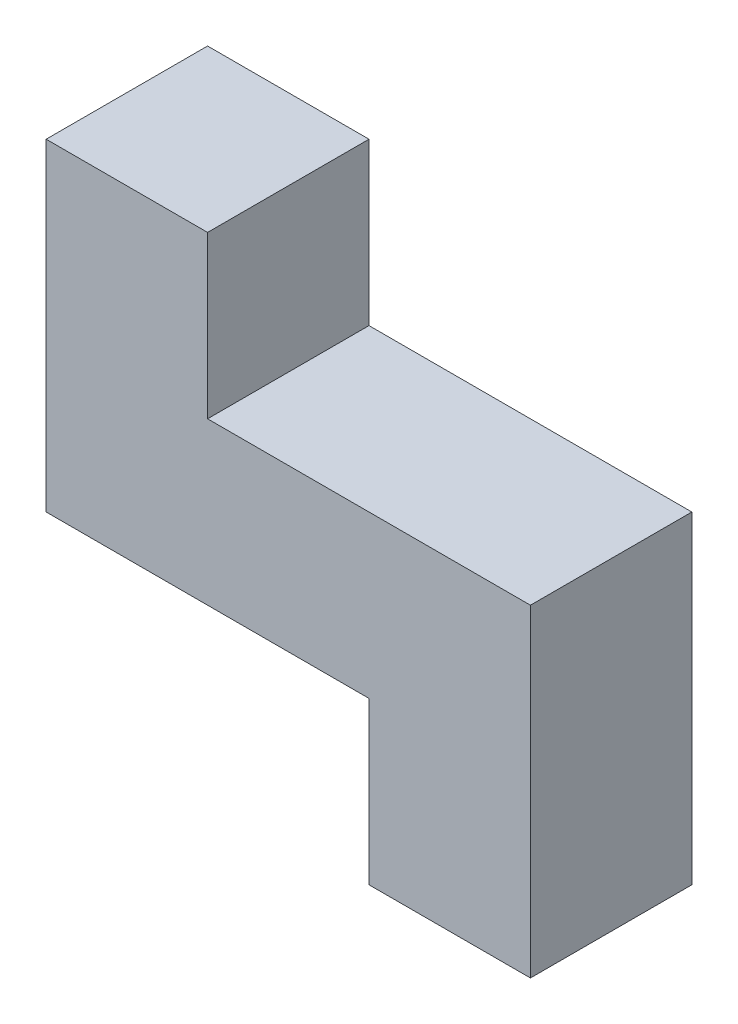
ISO-10303-21;
HEADER;
FILE_DESCRIPTION(('STEP AP214'),'2;1');
FILE_NAME('part.step','',(''),(''),'','','');
FILE_SCHEMA(('AUTOMOTIVE_DESIGN { 1 0 10303 214 1 1 1 1 }'));
ENDSEC;
DATA;
#1=APPLICATION_CONTEXT('core data for automotive mechanical design processes');
#2=APPLICATION_PROTOCOL_DEFINITION('international standard','automotive_design',2000,#1);
#3=PRODUCT_CONTEXT('',#1,'mechanical');
#4=PRODUCT('Part','Part','',(#3));
#5=PRODUCT_RELATED_PRODUCT_CATEGORY('part','',(#4));
#6=PRODUCT_DEFINITION_FORMATION('','',#4);
#7=PRODUCT_DEFINITION_CONTEXT('part definition',#1,'design');
#8=PRODUCT_DEFINITION('design','',#6,#7);
#9=PRODUCT_DEFINITION_SHAPE('','',#8);
#10=(LENGTH_UNIT() NAMED_UNIT(*) SI_UNIT(.MILLI.,.METRE.));
#11=(NAMED_UNIT(*) PLANE_ANGLE_UNIT() SI_UNIT($,.RADIAN.));
#12=(NAMED_UNIT(*) SI_UNIT($,.STERADIAN.) SOLID_ANGLE_UNIT());
#13=UNCERTAINTY_MEASURE_WITH_UNIT(LENGTH_MEASURE(1.E-05),#10,'distance_accuracy_value','');
#14=(GEOMETRIC_REPRESENTATION_CONTEXT(3) GLOBAL_UNCERTAINTY_ASSIGNED_CONTEXT((#13)) GLOBAL_UNIT_ASSIGNED_CONTEXT((#10,
#11,#12)) REPRESENTATION_CONTEXT('',''));
#15=CARTESIAN_POINT('',(0.,0.,0.));
#16=DIRECTION('',(0.,0.,1.));
#17=DIRECTION('',(1.,0.,0.));
#18=AXIS2_PLACEMENT_3D('',#15,#16,#17);
#19=CARTESIAN_POINT('',(25.4,76.2,25.4));
#20=DIRECTION('',(0.,-1.,0.));
#21=DIRECTION('',(0.,0.,-1.));
#22=AXIS2_PLACEMENT_3D('',#19,#20,#21);
#23=PLANE('',#22);
#24=DIRECTION('',(-1.,0.,0.));
#25=VECTOR('',#24,1.);
#26=CARTESIAN_POINT('',(25.4,76.2,0.));
#27=LINE('',#26,#25);
#28=CARTESIAN_POINT('',(25.4,76.2,0.));
#29=VERTEX_POINT('',#28);
#30=CARTESIAN_POINT('',(0.,76.2,0.));
#31=VERTEX_POINT('',#30);
#32=EDGE_CURVE('E129',#29,#31,#27,.T.);
#33=ORIENTED_EDGE('',*,*,#32,.T.);
#34=DIRECTION('',(0.,0.,-1.));
#35=VECTOR('',#34,1.);
#36=CARTESIAN_POINT('',(0.,76.2,25.4));
#37=LINE('',#36,#35);
#38=CARTESIAN_POINT('',(0.,76.2,25.4));
#39=VERTEX_POINT('',#38);
#40=EDGE_CURVE('E11',#39,#31,#37,.T.);
#41=ORIENTED_EDGE('',*,*,#40,.F.);
#42=DIRECTION('',(-1.,0.,0.));
#43=VECTOR('',#42,1.);
#44=CARTESIAN_POINT('',(25.4,76.2,25.4));
#45=LINE('',#44,#43);
#46=CARTESIAN_POINT('',(25.4,76.2,25.4));
#47=VERTEX_POINT('',#46);
#48=EDGE_CURVE('E143',#47,#39,#45,.T.);
#49=ORIENTED_EDGE('',*,*,#48,.F.);
#50=DIRECTION('',(0.,0.,-1.));
#51=VECTOR('',#50,1.);
#52=CARTESIAN_POINT('',(25.4,76.2,25.4));
#53=LINE('',#52,#51);
#54=EDGE_CURVE('E125',#47,#29,#53,.T.);
#55=ORIENTED_EDGE('',*,*,#54,.T.);
#56=EDGE_LOOP('',(#33,#41,#49,#55));
#57=FACE_BOUND('',#56,.T.);
#58=ADVANCED_FACE('F33',(#57),#23,.F.);
#59=CARTESIAN_POINT('',(0.,76.2,25.4));
#60=DIRECTION('',(1.,0.,0.));
#61=DIRECTION('',(0.,0.,-1.));
#62=AXIS2_PLACEMENT_3D('',#59,#60,#61);
#63=PLANE('',#62);
#64=DIRECTION('',(0.,-1.,0.));
#65=VECTOR('',#64,1.);
#66=CARTESIAN_POINT('',(0.,76.2,0.));
#67=LINE('',#66,#65);
#68=CARTESIAN_POINT('',(0.,25.4,0.));
#69=VERTEX_POINT('',#68);
#70=EDGE_CURVE('E132',#31,#69,#67,.T.);
#71=ORIENTED_EDGE('',*,*,#70,.T.);
#72=DIRECTION('',(0.,0.,-1.));
#73=VECTOR('',#72,1.);
#74=CARTESIAN_POINT('',(0.,25.4,25.4));
#75=LINE('',#74,#73);
#76=CARTESIAN_POINT('',(0.,25.4,25.4));
#77=VERTEX_POINT('',#76);
#78=EDGE_CURVE('E41',#77,#69,#75,.T.);
#79=ORIENTED_EDGE('',*,*,#78,.F.);
#80=DIRECTION('',(0.,-1.,0.));
#81=VECTOR('',#80,1.);
#82=CARTESIAN_POINT('',(0.,76.2,25.4));
#83=LINE('',#82,#81);
#84=EDGE_CURVE('E92',#39,#77,#83,.T.);
#85=ORIENTED_EDGE('',*,*,#84,.F.);
#86=ORIENTED_EDGE('',*,*,#40,.T.);
#87=EDGE_LOOP('',(#71,#79,#85,#86));
#88=FACE_BOUND('',#87,.T.);
#89=ADVANCED_FACE('F178',(#88),#63,.F.);
#90=CARTESIAN_POINT('',(0.,25.4,25.4));
#91=DIRECTION('',(0.,1.,0.));
#92=DIRECTION('',(0.,0.,1.));
#93=AXIS2_PLACEMENT_3D('',#90,#91,#92);
#94=PLANE('',#93);
#95=DIRECTION('',(1.,0.,0.));
#96=VECTOR('',#95,1.);
#97=CARTESIAN_POINT('',(0.,25.4,0.));
#98=LINE('',#97,#96);
#99=CARTESIAN_POINT('',(50.8,25.4,0.));
#100=VERTEX_POINT('',#99);
#101=EDGE_CURVE('E134',#69,#100,#98,.T.);
#102=ORIENTED_EDGE('',*,*,#101,.T.);
#103=DIRECTION('',(0.,0.,-1.));
#104=VECTOR('',#103,1.);
#105=CARTESIAN_POINT('',(50.8,25.4,25.4));
#106=LINE('',#105,#104);
#107=CARTESIAN_POINT('',(50.8,25.4,25.4));
#108=VERTEX_POINT('',#107);
#109=EDGE_CURVE('E150',#108,#100,#106,.T.);
#110=ORIENTED_EDGE('',*,*,#109,.F.);
#111=DIRECTION('',(1.,0.,0.));
#112=VECTOR('',#111,1.);
#113=CARTESIAN_POINT('',(0.,25.4,25.4));
#114=LINE('',#113,#112);
#115=EDGE_CURVE('E158',#77,#108,#114,.T.);
#116=ORIENTED_EDGE('',*,*,#115,.F.);
#117=ORIENTED_EDGE('',*,*,#78,.T.);
#118=EDGE_LOOP('',(#102,#110,#116,#117));
#119=FACE_BOUND('',#118,.T.);
#120=ADVANCED_FACE('F156',(#119),#94,.F.);
#121=CARTESIAN_POINT('',(50.8,25.4,25.4));
#122=DIRECTION('',(1.,0.,0.));
#123=DIRECTION('',(0.,0.,-1.));
#124=AXIS2_PLACEMENT_3D('',#121,#122,#123);
#125=PLANE('',#124);
#126=DIRECTION('',(0.,-1.,0.));
#127=VECTOR('',#126,1.);
#128=CARTESIAN_POINT('',(50.8,25.4,0.));
#129=LINE('',#128,#127);
#130=CARTESIAN_POINT('',(50.8,0.,0.));
#131=VERTEX_POINT('',#130);
#132=EDGE_CURVE('E136',#100,#131,#129,.T.);
#133=ORIENTED_EDGE('',*,*,#132,.T.);
#134=DIRECTION('',(0.,0.,-1.));
#135=VECTOR('',#134,1.);
#136=CARTESIAN_POINT('',(50.8,0.,25.4));
#137=LINE('',#136,#135);
#138=CARTESIAN_POINT('',(50.8,0.,25.4));
#139=VERTEX_POINT('',#138);
#140=EDGE_CURVE('E147',#139,#131,#137,.T.);
#141=ORIENTED_EDGE('',*,*,#140,.F.);
#142=DIRECTION('',(0.,-1.,0.));
#143=VECTOR('',#142,1.);
#144=CARTESIAN_POINT('',(50.8,25.4,25.4));
#145=LINE('',#144,#143);
#146=EDGE_CURVE('E170',#108,#139,#145,.T.);
#147=ORIENTED_EDGE('',*,*,#146,.F.);
#148=ORIENTED_EDGE('',*,*,#109,.T.);
#149=EDGE_LOOP('',(#133,#141,#147,#148));
#150=FACE_BOUND('',#149,.T.);
#151=ADVANCED_FACE('F166',(#150),#125,.F.);
#152=CARTESIAN_POINT('',(50.8,0.,25.4));
#153=DIRECTION('',(0.,1.,0.));
#154=DIRECTION('',(0.,0.,1.));
#155=AXIS2_PLACEMENT_3D('',#152,#153,#154);
#156=PLANE('',#155);
#157=DIRECTION('',(1.,0.,0.));
#158=VECTOR('',#157,1.);
#159=CARTESIAN_POINT('',(50.8,0.,0.));
#160=LINE('',#159,#158);
#161=CARTESIAN_POINT('',(76.2,0.,0.));
#162=VERTEX_POINT('',#161);
#163=EDGE_CURVE('E138',#131,#162,#160,.T.);
#164=ORIENTED_EDGE('',*,*,#163,.T.);
#165=DIRECTION('',(0.,0.,-1.));
#166=VECTOR('',#165,1.);
#167=CARTESIAN_POINT('',(76.2,0.,25.4));
#168=LINE('',#167,#166);
#169=CARTESIAN_POINT('',(76.2,0.,25.4));
#170=VERTEX_POINT('',#169);
#171=EDGE_CURVE('E120',#170,#162,#168,.T.);
#172=ORIENTED_EDGE('',*,*,#171,.F.);
#173=DIRECTION('',(1.,0.,0.));
#174=VECTOR('',#173,1.);
#175=CARTESIAN_POINT('',(50.8,0.,25.4));
#176=LINE('',#175,#174);
#177=EDGE_CURVE('E111',#139,#170,#176,.T.);
#178=ORIENTED_EDGE('',*,*,#177,.F.);
#179=ORIENTED_EDGE('',*,*,#140,.T.);
#180=EDGE_LOOP('',(#164,#172,#178,#179));
#181=FACE_BOUND('',#180,.T.);
#182=ADVANCED_FACE('F169',(#181),#156,.F.);
#183=CARTESIAN_POINT('',(76.2,0.,25.4));
#184=DIRECTION('',(-1.,0.,0.));
#185=DIRECTION('',(0.,0.,1.));
#186=AXIS2_PLACEMENT_3D('',#183,#184,#185);
#187=PLANE('',#186);
#188=DIRECTION('',(0.,1.,0.));
#189=VECTOR('',#188,1.);
#190=CARTESIAN_POINT('',(76.2,0.,0.));
#191=LINE('',#190,#189);
#192=CARTESIAN_POINT('',(76.2,50.8,0.));
#193=VERTEX_POINT('',#192);
#194=EDGE_CURVE('E119',#162,#193,#191,.T.);
#195=ORIENTED_EDGE('',*,*,#194,.T.);
#196=DIRECTION('',(0.,0.,-1.));
#197=VECTOR('',#196,1.);
#198=CARTESIAN_POINT('',(76.2,50.8,25.4));
#199=LINE('',#198,#197);
#200=CARTESIAN_POINT('',(76.2,50.8,25.4));
#201=VERTEX_POINT('',#200);
#202=EDGE_CURVE('E116',#201,#193,#199,.T.);
#203=ORIENTED_EDGE('',*,*,#202,.F.);
#204=DIRECTION('',(0.,1.,0.));
#205=VECTOR('',#204,1.);
#206=CARTESIAN_POINT('',(76.2,0.,25.4));
#207=LINE('',#206,#205);
#208=EDGE_CURVE('E105',#170,#201,#207,.T.);
#209=ORIENTED_EDGE('',*,*,#208,.F.);
#210=ORIENTED_EDGE('',*,*,#171,.T.);
#211=EDGE_LOOP('',(#195,#203,#209,#210));
#212=FACE_BOUND('',#211,.T.);
#213=ADVANCED_FACE('F117',(#212),#187,.F.);
#214=CARTESIAN_POINT('',(76.2,50.8,25.4));
#215=DIRECTION('',(0.,-1.,0.));
#216=DIRECTION('',(0.,0.,-1.));
#217=AXIS2_PLACEMENT_3D('',#214,#215,#216);
#218=PLANE('',#217);
#219=DIRECTION('',(-1.,0.,0.));
#220=VECTOR('',#219,1.);
#221=CARTESIAN_POINT('',(76.2,50.8,0.));
#222=LINE('',#221,#220);
#223=CARTESIAN_POINT('',(25.4,50.8,0.));
#224=VERTEX_POINT('',#223);
#225=EDGE_CURVE('E78',#193,#224,#222,.T.);
#226=ORIENTED_EDGE('',*,*,#225,.T.);
#227=DIRECTION('',(0.,0.,-1.));
#228=VECTOR('',#227,1.);
#229=CARTESIAN_POINT('',(25.4,50.8,25.4));
#230=LINE('',#229,#228);
#231=CARTESIAN_POINT('',(25.4,50.8,25.4));
#232=VERTEX_POINT('',#231);
#233=EDGE_CURVE('E121',#232,#224,#230,.T.);
#234=ORIENTED_EDGE('',*,*,#233,.F.);
#235=DIRECTION('',(-1.,0.,0.));
#236=VECTOR('',#235,1.);
#237=CARTESIAN_POINT('',(76.2,50.8,25.4));
#238=LINE('',#237,#236);
#239=EDGE_CURVE('E109',#201,#232,#238,.T.);
#240=ORIENTED_EDGE('',*,*,#239,.F.);
#241=ORIENTED_EDGE('',*,*,#202,.T.);
#242=EDGE_LOOP('',(#226,#234,#240,#241));
#243=FACE_BOUND('',#242,.T.);
#244=ADVANCED_FACE('F123',(#243),#218,.F.);
#245=CARTESIAN_POINT('',(25.4,50.8,25.4));
#246=DIRECTION('',(-1.,0.,0.));
#247=DIRECTION('',(0.,0.,1.));
#248=AXIS2_PLACEMENT_3D('',#245,#246,#247);
#249=PLANE('',#248);
#250=DIRECTION('',(0.,1.,0.));
#251=VECTOR('',#250,1.);
#252=CARTESIAN_POINT('',(25.4,50.8,0.));
#253=LINE('',#252,#251);
#254=EDGE_CURVE('E84',#224,#29,#253,.T.);
#255=ORIENTED_EDGE('',*,*,#254,.T.);
#256=ORIENTED_EDGE('',*,*,#54,.F.);
#257=DIRECTION('',(0.,1.,0.));
#258=VECTOR('',#257,1.);
#259=CARTESIAN_POINT('',(25.4,50.8,25.4));
#260=LINE('',#259,#258);
#261=EDGE_CURVE('E49',#232,#47,#260,.T.);
#262=ORIENTED_EDGE('',*,*,#261,.F.);
#263=ORIENTED_EDGE('',*,*,#233,.T.);
#264=EDGE_LOOP('',(#255,#256,#262,#263));
#265=FACE_BOUND('',#264,.T.);
#266=ADVANCED_FACE('F194',(#265),#249,.F.);
#267=CARTESIAN_POINT('',(0.,0.,25.4));
#268=DIRECTION('',(0.,0.,1.));
#269=DIRECTION('',(1.,0.,0.));
#270=AXIS2_PLACEMENT_3D('',#267,#268,#269);
#271=PLANE('',#270);
#272=ORIENTED_EDGE('',*,*,#48,.T.);
#273=ORIENTED_EDGE('',*,*,#84,.T.);
#274=ORIENTED_EDGE('',*,*,#115,.T.);
#275=ORIENTED_EDGE('',*,*,#146,.T.);
#276=ORIENTED_EDGE('',*,*,#177,.T.);
#277=ORIENTED_EDGE('',*,*,#208,.T.);
#278=ORIENTED_EDGE('',*,*,#239,.T.);
#279=ORIENTED_EDGE('',*,*,#261,.T.);
#280=EDGE_LOOP('',(#272,#273,#274,#275,#276,#277,#278,#279));
#281=FACE_BOUND('',#280,.T.);
#282=ADVANCED_FACE('F107',(#281),#271,.T.);
#283=CARTESIAN_POINT('',(0.,0.,0.));
#284=DIRECTION('',(0.,0.,1.));
#285=DIRECTION('',(1.,0.,0.));
#286=AXIS2_PLACEMENT_3D('',#283,#284,#285);
#287=PLANE('',#286);
#288=ORIENTED_EDGE('',*,*,#32,.F.);
#289=ORIENTED_EDGE('',*,*,#254,.F.);
#290=ORIENTED_EDGE('',*,*,#225,.F.);
#291=ORIENTED_EDGE('',*,*,#194,.F.);
#292=ORIENTED_EDGE('',*,*,#163,.F.);
#293=ORIENTED_EDGE('',*,*,#132,.F.);
#294=ORIENTED_EDGE('',*,*,#101,.F.);
#295=ORIENTED_EDGE('',*,*,#70,.F.);
#296=EDGE_LOOP('',(#288,#289,#290,#291,#292,#293,#294,#295));
#297=FACE_BOUND('',#296,.T.);
#298=ADVANCED_FACE('F162',(#297),#287,.F.);
#299=CLOSED_SHELL('',(#58,#89,#120,#151,#182,#213,#244,#266,#282,#298));
#300=MANIFOLD_SOLID_BREP('B2',#299);
#301=ADVANCED_BREP_SHAPE_REPRESENTATION('',(#18,#300),#14);
#302=SHAPE_DEFINITION_REPRESENTATION(#9,#301);
ENDSEC;
END-ISO-10303-21;
